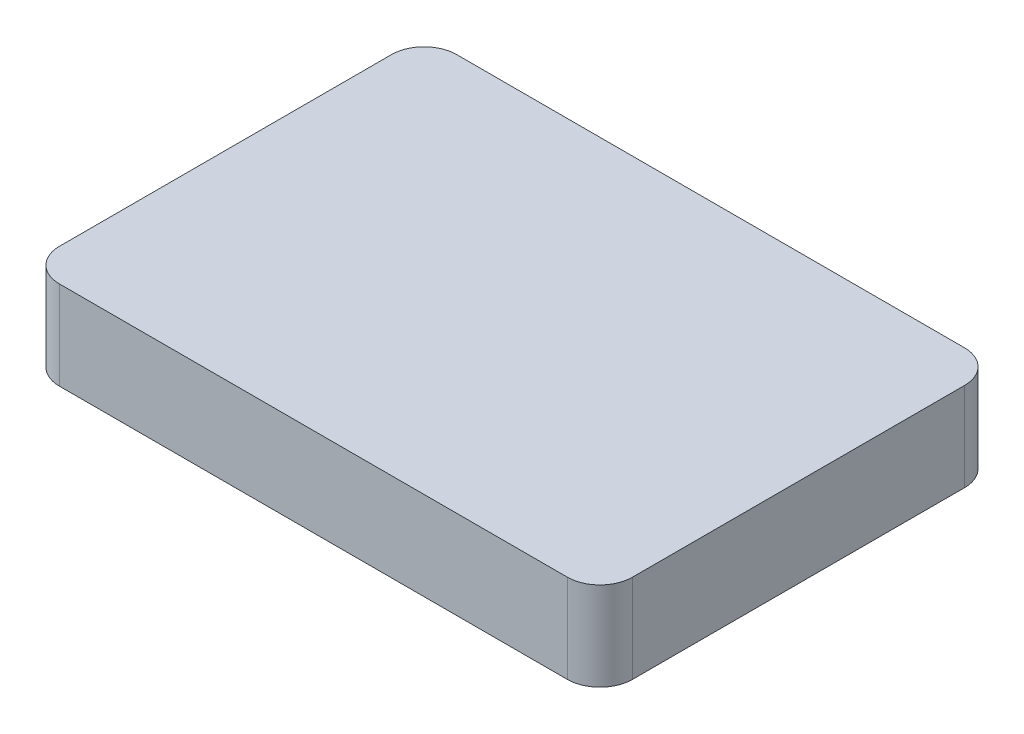
ISO-10303-21;
HEADER;
FILE_DESCRIPTION(('STEP AP214'),'2;1');
FILE_NAME('part.step','',(''),(''),'','','');
FILE_SCHEMA(('AUTOMOTIVE_DESIGN { 1 0 10303 214 1 1 1 1 }'));
ENDSEC;
DATA;
#1=APPLICATION_CONTEXT('core data for automotive mechanical design processes');
#2=APPLICATION_PROTOCOL_DEFINITION('international standard','automotive_design',2000,#1);
#3=PRODUCT_CONTEXT('',#1,'mechanical');
#4=PRODUCT('Part','Part','',(#3));
#5=PRODUCT_RELATED_PRODUCT_CATEGORY('part','',(#4));
#6=PRODUCT_DEFINITION_FORMATION('','',#4);
#7=PRODUCT_DEFINITION_CONTEXT('part definition',#1,'design');
#8=PRODUCT_DEFINITION('design','',#6,#7);
#9=PRODUCT_DEFINITION_SHAPE('','',#8);
#10=(LENGTH_UNIT() NAMED_UNIT(*) SI_UNIT(.MILLI.,.METRE.));
#11=(NAMED_UNIT(*) PLANE_ANGLE_UNIT() SI_UNIT($,.RADIAN.));
#12=(NAMED_UNIT(*) SI_UNIT($,.STERADIAN.) SOLID_ANGLE_UNIT());
#13=UNCERTAINTY_MEASURE_WITH_UNIT(LENGTH_MEASURE(1.E-05),#10,'distance_accuracy_value','');
#14=(GEOMETRIC_REPRESENTATION_CONTEXT(3) GLOBAL_UNCERTAINTY_ASSIGNED_CONTEXT((#13)) GLOBAL_UNIT_ASSIGNED_CONTEXT((#10,
#11,#12)) REPRESENTATION_CONTEXT('',''));
#15=CARTESIAN_POINT('',(0.,0.,0.));
#16=DIRECTION('',(0.,0.,1.));
#17=DIRECTION('',(1.,0.,0.));
#18=AXIS2_PLACEMENT_3D('',#15,#16,#17);
#19=CARTESIAN_POINT('',(22.,3.4,15.25));
#20=DIRECTION('',(-1.,0.,0.));
#21=DIRECTION('',(0.,0.,1.));
#22=AXIS2_PLACEMENT_3D('',#19,#20,#21);
#23=PLANE('',#22);
#24=DIRECTION('',(0.,0.,-1.));
#25=VECTOR('',#24,1.);
#26=CARTESIAN_POINT('',(22.,-3.4,15.25));
#27=LINE('',#26,#25);
#28=CARTESIAN_POINT('',(22.,-3.4,12.75));
#29=VERTEX_POINT('',#28);
#30=CARTESIAN_POINT('',(22.,-3.4,-12.75));
#31=VERTEX_POINT('',#30);
#32=EDGE_CURVE('E141',#29,#31,#27,.T.);
#33=ORIENTED_EDGE('',*,*,#32,.T.);
#34=DIRECTION('',(0.,-1.,0.));
#35=VECTOR('',#34,1.);
#36=CARTESIAN_POINT('',(22.,3.4,-12.75));
#37=LINE('',#36,#35);
#38=CARTESIAN_POINT('',(22.,3.4,-12.75));
#39=VERTEX_POINT('',#38);
#40=EDGE_CURVE('E175',#31,#39,#37,.F.);
#41=ORIENTED_EDGE('',*,*,#40,.T.);
#42=DIRECTION('',(0.,0.,-1.));
#43=VECTOR('',#42,1.);
#44=CARTESIAN_POINT('',(22.,3.4,15.25));
#45=LINE('',#44,#43);
#46=CARTESIAN_POINT('',(22.,3.4,12.75));
#47=VERTEX_POINT('',#46);
#48=EDGE_CURVE('E139',#47,#39,#45,.T.);
#49=ORIENTED_EDGE('',*,*,#48,.F.);
#50=DIRECTION('',(0.,-1.,0.));
#51=VECTOR('',#50,1.);
#52=CARTESIAN_POINT('',(22.,3.4,12.75));
#53=LINE('',#52,#51);
#54=EDGE_CURVE('E171',#47,#29,#53,.T.);
#55=ORIENTED_EDGE('',*,*,#54,.T.);
#56=EDGE_LOOP('',(#33,#41,#49,#55));
#57=FACE_BOUND('',#56,.T.);
#58=ADVANCED_FACE('F40',(#57),#23,.F.);
#59=CARTESIAN_POINT('',(-22.,3.4,-15.25));
#60=DIRECTION('',(0.,0.,1.));
#61=DIRECTION('',(1.,0.,0.));
#62=AXIS2_PLACEMENT_3D('',#59,#60,#61);
#63=PLANE('',#62);
#64=DIRECTION('',(-1.,0.,0.));
#65=VECTOR('',#64,1.);
#66=CARTESIAN_POINT('',(-22.,-3.4,-15.25));
#67=LINE('',#66,#65);
#68=CARTESIAN_POINT('',(19.5,-3.4,-15.25));
#69=VERTEX_POINT('',#68);
#70=CARTESIAN_POINT('',(-19.5,-3.4,-15.25));
#71=VERTEX_POINT('',#70);
#72=EDGE_CURVE('E135',#69,#71,#67,.T.);
#73=ORIENTED_EDGE('',*,*,#72,.T.);
#74=DIRECTION('',(0.,-1.,0.));
#75=VECTOR('',#74,1.);
#76=CARTESIAN_POINT('',(-19.5,3.4,-15.25));
#77=LINE('',#76,#75);
#78=CARTESIAN_POINT('',(-19.5,3.4,-15.25));
#79=VERTEX_POINT('',#78);
#80=EDGE_CURVE('E111',#71,#79,#77,.F.);
#81=ORIENTED_EDGE('',*,*,#80,.T.);
#82=DIRECTION('',(-1.,0.,0.));
#83=VECTOR('',#82,1.);
#84=CARTESIAN_POINT('',(-22.,3.4,-15.25));
#85=LINE('',#84,#83);
#86=CARTESIAN_POINT('',(19.5,3.4,-15.25));
#87=VERTEX_POINT('',#86);
#88=EDGE_CURVE('E194',#87,#79,#85,.T.);
#89=ORIENTED_EDGE('',*,*,#88,.F.);
#90=DIRECTION('',(0.,-1.,0.));
#91=VECTOR('',#90,1.);
#92=CARTESIAN_POINT('',(19.5,3.4,-15.25));
#93=LINE('',#92,#91);
#94=EDGE_CURVE('E117',#87,#69,#93,.T.);
#95=ORIENTED_EDGE('',*,*,#94,.T.);
#96=EDGE_LOOP('',(#73,#81,#89,#95));
#97=FACE_BOUND('',#96,.T.);
#98=ADVANCED_FACE('F215',(#97),#63,.F.);
#99=CARTESIAN_POINT('',(-22.,3.4,15.25));
#100=DIRECTION('',(1.,0.,0.));
#101=DIRECTION('',(0.,0.,-1.));
#102=AXIS2_PLACEMENT_3D('',#99,#100,#101);
#103=PLANE('',#102);
#104=DIRECTION('',(0.,0.,1.));
#105=VECTOR('',#104,1.);
#106=CARTESIAN_POINT('',(-22.,3.4,15.25));
#107=LINE('',#106,#105);
#108=CARTESIAN_POINT('',(-22.,3.4,-12.75));
#109=VERTEX_POINT('',#108);
#110=CARTESIAN_POINT('',(-22.,3.4,12.75));
#111=VERTEX_POINT('',#110);
#112=EDGE_CURVE('E126',#109,#111,#107,.T.);
#113=ORIENTED_EDGE('',*,*,#112,.F.);
#114=DIRECTION('',(0.,-1.,0.));
#115=VECTOR('',#114,1.);
#116=CARTESIAN_POINT('',(-22.,3.4,-12.75));
#117=LINE('',#116,#115);
#118=CARTESIAN_POINT('',(-22.,-3.4,-12.75));
#119=VERTEX_POINT('',#118);
#120=EDGE_CURVE('E110',#109,#119,#117,.T.);
#121=ORIENTED_EDGE('',*,*,#120,.T.);
#122=DIRECTION('',(0.,0.,1.));
#123=VECTOR('',#122,1.);
#124=CARTESIAN_POINT('',(-22.,-3.4,15.25));
#125=LINE('',#124,#123);
#126=CARTESIAN_POINT('',(-22.,-3.4,12.75));
#127=VERTEX_POINT('',#126);
#128=EDGE_CURVE('E124',#119,#127,#125,.T.);
#129=ORIENTED_EDGE('',*,*,#128,.T.);
#130=DIRECTION('',(0.,-1.,0.));
#131=VECTOR('',#130,1.);
#132=CARTESIAN_POINT('',(-22.,3.4,12.75));
#133=LINE('',#132,#131);
#134=EDGE_CURVE('E129',#127,#111,#133,.F.);
#135=ORIENTED_EDGE('',*,*,#134,.T.);
#136=EDGE_LOOP('',(#113,#121,#129,#135));
#137=FACE_BOUND('',#136,.T.);
#138=ADVANCED_FACE('F123',(#137),#103,.F.);
#139=CARTESIAN_POINT('',(-22.,3.4,15.25));
#140=DIRECTION('',(0.,0.,-1.));
#141=DIRECTION('',(-1.,0.,0.));
#142=AXIS2_PLACEMENT_3D('',#139,#140,#141);
#143=PLANE('',#142);
#144=DIRECTION('',(1.,0.,0.));
#145=VECTOR('',#144,1.);
#146=CARTESIAN_POINT('',(-22.,-3.4,15.25));
#147=LINE('',#146,#145);
#148=CARTESIAN_POINT('',(-19.5,-3.4,15.25));
#149=VERTEX_POINT('',#148);
#150=CARTESIAN_POINT('',(19.5,-3.4,15.25));
#151=VERTEX_POINT('',#150);
#152=EDGE_CURVE('E134',#149,#151,#147,.T.);
#153=ORIENTED_EDGE('',*,*,#152,.T.);
#154=DIRECTION('',(0.,-1.,0.));
#155=VECTOR('',#154,1.);
#156=CARTESIAN_POINT('',(19.5,3.4,15.25));
#157=LINE('',#156,#155);
#158=CARTESIAN_POINT('',(19.5,3.4,15.25));
#159=VERTEX_POINT('',#158);
#160=EDGE_CURVE('E11',#151,#159,#157,.F.);
#161=ORIENTED_EDGE('',*,*,#160,.T.);
#162=DIRECTION('',(1.,0.,0.));
#163=VECTOR('',#162,1.);
#164=CARTESIAN_POINT('',(-22.,3.4,15.25));
#165=LINE('',#164,#163);
#166=CARTESIAN_POINT('',(-19.5,3.4,15.25));
#167=VERTEX_POINT('',#166);
#168=EDGE_CURVE('E146',#167,#159,#165,.T.);
#169=ORIENTED_EDGE('',*,*,#168,.F.);
#170=DIRECTION('',(0.,-1.,0.));
#171=VECTOR('',#170,1.);
#172=CARTESIAN_POINT('',(-19.5,3.4,15.25));
#173=LINE('',#172,#171);
#174=EDGE_CURVE('E49',#167,#149,#173,.T.);
#175=ORIENTED_EDGE('',*,*,#174,.T.);
#176=EDGE_LOOP('',(#153,#161,#169,#175));
#177=FACE_BOUND('',#176,.T.);
#178=ADVANCED_FACE('F180',(#177),#143,.F.);
#179=CARTESIAN_POINT('',(0.,3.4,0.));
#180=DIRECTION('',(0.,-1.,0.));
#181=DIRECTION('',(0.,0.,-1.));
#182=AXIS2_PLACEMENT_3D('',#179,#180,#181);
#183=PLANE('',#182);
#184=ORIENTED_EDGE('',*,*,#88,.T.);
#185=CARTESIAN_POINT('',(-19.5,3.4,-12.75));
#186=DIRECTION('',(0.,-1.,0.));
#187=DIRECTION('',(0.,0.,-1.));
#188=AXIS2_PLACEMENT_3D('',#185,#186,#187);
#189=CIRCLE('',#188,2.5);
#190=EDGE_CURVE('E168',#79,#109,#189,.F.);
#191=ORIENTED_EDGE('',*,*,#190,.T.);
#192=ORIENTED_EDGE('',*,*,#112,.T.);
#193=CARTESIAN_POINT('',(-19.5,3.4,12.75));
#194=DIRECTION('',(0.,-1.,0.));
#195=DIRECTION('',(0.,0.,-1.));
#196=AXIS2_PLACEMENT_3D('',#193,#194,#195);
#197=CIRCLE('',#196,2.5);
#198=EDGE_CURVE('E61',#111,#167,#197,.F.);
#199=ORIENTED_EDGE('',*,*,#198,.T.);
#200=ORIENTED_EDGE('',*,*,#168,.T.);
#201=CARTESIAN_POINT('',(19.5,3.4,12.75));
#202=DIRECTION('',(0.,-1.,0.));
#203=DIRECTION('',(0.,0.,-1.));
#204=AXIS2_PLACEMENT_3D('',#201,#202,#203);
#205=CIRCLE('',#204,2.5);
#206=EDGE_CURVE('E162',#159,#47,#205,.F.);
#207=ORIENTED_EDGE('',*,*,#206,.T.);
#208=ORIENTED_EDGE('',*,*,#48,.T.);
#209=CARTESIAN_POINT('',(19.5,3.4,-12.75));
#210=DIRECTION('',(0.,-1.,0.));
#211=DIRECTION('',(0.,0.,-1.));
#212=AXIS2_PLACEMENT_3D('',#209,#210,#211);
#213=CIRCLE('',#212,2.5);
#214=EDGE_CURVE('E165',#39,#87,#213,.F.);
#215=ORIENTED_EDGE('',*,*,#214,.T.);
#216=EDGE_LOOP('',(#184,#191,#192,#199,#200,#207,#208,#215));
#217=FACE_BOUND('',#216,.T.);
#218=ADVANCED_FACE('F204',(#217),#183,.F.);
#219=CARTESIAN_POINT('',(0.,-3.4,0.));
#220=DIRECTION('',(0.,-1.,0.));
#221=DIRECTION('',(0.,0.,-1.));
#222=AXIS2_PLACEMENT_3D('',#219,#220,#221);
#223=PLANE('',#222);
#224=ORIENTED_EDGE('',*,*,#128,.F.);
#225=CARTESIAN_POINT('',(-19.5,-3.4,-12.75));
#226=DIRECTION('',(0.,-1.,0.));
#227=DIRECTION('',(0.,0.,-1.));
#228=AXIS2_PLACEMENT_3D('',#225,#226,#227);
#229=CIRCLE('',#228,2.5);
#230=EDGE_CURVE('E106',#119,#71,#229,.T.);
#231=ORIENTED_EDGE('',*,*,#230,.T.);
#232=ORIENTED_EDGE('',*,*,#72,.F.);
#233=CARTESIAN_POINT('',(19.5,-3.4,-12.75));
#234=DIRECTION('',(0.,-1.,0.));
#235=DIRECTION('',(0.,0.,-1.));
#236=AXIS2_PLACEMENT_3D('',#233,#234,#235);
#237=CIRCLE('',#236,2.5);
#238=EDGE_CURVE('E118',#69,#31,#237,.T.);
#239=ORIENTED_EDGE('',*,*,#238,.T.);
#240=ORIENTED_EDGE('',*,*,#32,.F.);
#241=CARTESIAN_POINT('',(19.5,-3.4,12.75));
#242=DIRECTION('',(0.,-1.,0.));
#243=DIRECTION('',(0.,0.,-1.));
#244=AXIS2_PLACEMENT_3D('',#241,#242,#243);
#245=CIRCLE('',#244,2.5);
#246=EDGE_CURVE('E150',#29,#151,#245,.T.);
#247=ORIENTED_EDGE('',*,*,#246,.T.);
#248=ORIENTED_EDGE('',*,*,#152,.F.);
#249=CARTESIAN_POINT('',(-19.5,-3.4,12.75));
#250=DIRECTION('',(0.,-1.,0.));
#251=DIRECTION('',(0.,0.,-1.));
#252=AXIS2_PLACEMENT_3D('',#249,#250,#251);
#253=CIRCLE('',#252,2.5);
#254=EDGE_CURVE('E128',#149,#127,#253,.T.);
#255=ORIENTED_EDGE('',*,*,#254,.T.);
#256=EDGE_LOOP('',(#224,#231,#232,#239,#240,#247,#248,#255));
#257=FACE_BOUND('',#256,.T.);
#258=ADVANCED_FACE('F131',(#257),#223,.T.);
#259=CARTESIAN_POINT('',(-19.5,3.4,-12.75));
#260=DIRECTION('',(0.,-1.,0.));
#261=DIRECTION('',(0.,0.,-1.));
#262=AXIS2_PLACEMENT_3D('',#259,#260,#261);
#263=CYLINDRICAL_SURFACE('',#262,2.5);
#264=ORIENTED_EDGE('',*,*,#190,.F.);
#265=ORIENTED_EDGE('',*,*,#80,.F.);
#266=ORIENTED_EDGE('',*,*,#230,.F.);
#267=ORIENTED_EDGE('',*,*,#120,.F.);
#268=EDGE_LOOP('',(#264,#265,#266,#267));
#269=FACE_BOUND('',#268,.T.);
#270=ADVANCED_FACE('F109',(#269),#263,.T.);
#271=CARTESIAN_POINT('',(19.5,3.4,-12.75));
#272=DIRECTION('',(0.,-1.,0.));
#273=DIRECTION('',(0.,0.,-1.));
#274=AXIS2_PLACEMENT_3D('',#271,#272,#273);
#275=CYLINDRICAL_SURFACE('',#274,2.5);
#276=ORIENTED_EDGE('',*,*,#214,.F.);
#277=ORIENTED_EDGE('',*,*,#40,.F.);
#278=ORIENTED_EDGE('',*,*,#238,.F.);
#279=ORIENTED_EDGE('',*,*,#94,.F.);
#280=EDGE_LOOP('',(#276,#277,#278,#279));
#281=FACE_BOUND('',#280,.T.);
#282=ADVANCED_FACE('F226',(#281),#275,.T.);
#283=CARTESIAN_POINT('',(19.5,3.4,12.75));
#284=DIRECTION('',(0.,-1.,0.));
#285=DIRECTION('',(0.,0.,-1.));
#286=AXIS2_PLACEMENT_3D('',#283,#284,#285);
#287=CYLINDRICAL_SURFACE('',#286,2.5);
#288=ORIENTED_EDGE('',*,*,#206,.F.);
#289=ORIENTED_EDGE('',*,*,#160,.F.);
#290=ORIENTED_EDGE('',*,*,#246,.F.);
#291=ORIENTED_EDGE('',*,*,#54,.F.);
#292=EDGE_LOOP('',(#288,#289,#290,#291));
#293=FACE_BOUND('',#292,.T.);
#294=ADVANCED_FACE('F187',(#293),#287,.T.);
#295=CARTESIAN_POINT('',(-19.5,3.4,12.75));
#296=DIRECTION('',(0.,-1.,0.));
#297=DIRECTION('',(0.,0.,-1.));
#298=AXIS2_PLACEMENT_3D('',#295,#296,#297);
#299=CYLINDRICAL_SURFACE('',#298,2.5);
#300=ORIENTED_EDGE('',*,*,#198,.F.);
#301=ORIENTED_EDGE('',*,*,#134,.F.);
#302=ORIENTED_EDGE('',*,*,#254,.F.);
#303=ORIENTED_EDGE('',*,*,#174,.F.);
#304=EDGE_LOOP('',(#300,#301,#302,#303));
#305=FACE_BOUND('',#304,.T.);
#306=ADVANCED_FACE('F42',(#305),#299,.T.);
#307=CLOSED_SHELL('',(#58,#98,#138,#178,#218,#258,#270,#282,#294,#306));
#308=MANIFOLD_SOLID_BREP('B2',#307);
#309=ADVANCED_BREP_SHAPE_REPRESENTATION('',(#18,#308),#14);
#310=SHAPE_DEFINITION_REPRESENTATION(#9,#309);
ENDSEC;
END-ISO-10303-21;
